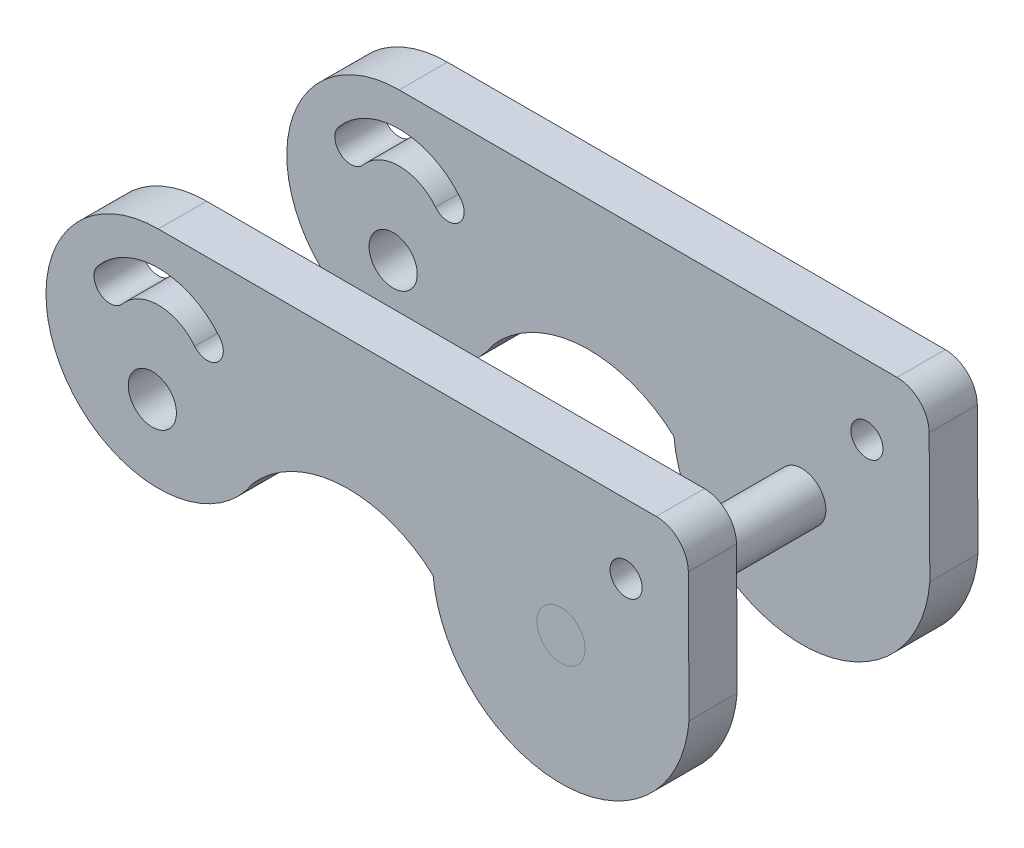
ISO-10303-21;
HEADER;
FILE_DESCRIPTION(('STEP AP214'),'2;1');
FILE_NAME('part.step','',(''),(''),'','','');
FILE_SCHEMA(('AUTOMOTIVE_DESIGN { 1 0 10303 214 1 1 1 1 }'));
ENDSEC;
DATA;
#1=APPLICATION_CONTEXT('core data for automotive mechanical design processes');
#2=APPLICATION_PROTOCOL_DEFINITION('international standard','automotive_design',2000,#1);
#3=PRODUCT_CONTEXT('',#1,'mechanical');
#4=PRODUCT('Part','Part','',(#3));
#5=PRODUCT_RELATED_PRODUCT_CATEGORY('part','',(#4));
#6=PRODUCT_DEFINITION_FORMATION('','',#4);
#7=PRODUCT_DEFINITION_CONTEXT('part definition',#1,'design');
#8=PRODUCT_DEFINITION('design','',#6,#7);
#9=PRODUCT_DEFINITION_SHAPE('','',#8);
#10=(LENGTH_UNIT() NAMED_UNIT(*) SI_UNIT(.MILLI.,.METRE.));
#11=(NAMED_UNIT(*) PLANE_ANGLE_UNIT() SI_UNIT($,.RADIAN.));
#12=(NAMED_UNIT(*) SI_UNIT($,.STERADIAN.) SOLID_ANGLE_UNIT());
#13=UNCERTAINTY_MEASURE_WITH_UNIT(LENGTH_MEASURE(1.E-05),#10,'distance_accuracy_value','');
#14=(GEOMETRIC_REPRESENTATION_CONTEXT(3) GLOBAL_UNCERTAINTY_ASSIGNED_CONTEXT((#13)) GLOBAL_UNIT_ASSIGNED_CONTEXT((#10,
#11,#12)) REPRESENTATION_CONTEXT('',''));
#15=CARTESIAN_POINT('',(0.,0.,0.));
#16=DIRECTION('',(0.,0.,1.));
#17=DIRECTION('',(1.,0.,0.));
#18=AXIS2_PLACEMENT_3D('',#15,#16,#17);
#19=CARTESIAN_POINT('',(8.75431331325364,33.2026229633381,-19.7857344309896));
#20=DIRECTION('',(0.,0.,-1.));
#21=DIRECTION('',(-1.,0.,0.));
#22=AXIS2_PLACEMENT_3D('',#19,#20,#21);
#23=CYLINDRICAL_SURFACE('',#22,1.5);
#24=CARTESIAN_POINT('',(8.75431331325364,33.2026229633381,-19.7857344309896));
#25=DIRECTION('',(0.,0.,1.));
#26=DIRECTION('',(1.,0.,0.));
#27=AXIS2_PLACEMENT_3D('',#24,#25,#26);
#28=CIRCLE('',#27,1.5);
#29=CARTESIAN_POINT('',(10.2543133132536,33.2026229633381,-19.7857344309896));
#30=VERTEX_POINT('',#29);
#31=EDGE_CURVE('P0_E9',#30,#30,#28,.T.);
#32=ORIENTED_EDGE('',*,*,#31,.F.);
#33=EDGE_LOOP('',(#32));
#34=FACE_BOUND('',#33,.T.);
#35=CARTESIAN_POINT('',(8.75431331325364,33.2026229633381,-37.7857344309896));
#36=DIRECTION('',(0.,0.,1.));
#37=DIRECTION('',(1.,0.,0.));
#38=AXIS2_PLACEMENT_3D('',#35,#36,#37);
#39=CIRCLE('',#38,1.5);
#40=CARTESIAN_POINT('',(10.2543133132536,33.2026229633381,-37.7857344309896));
#41=VERTEX_POINT('',#40);
#42=EDGE_CURVE('P0_E17',#41,#41,#39,.T.);
#43=ORIENTED_EDGE('',*,*,#42,.T.);
#44=EDGE_LOOP('',(#43));
#45=FACE_BOUND('',#44,.T.);
#46=ADVANCED_FACE('P0_F14',(#34,#45),#23,.T.);
#47=CARTESIAN_POINT('',(8.75431331325364,33.2026229633381,-19.7857344309896));
#48=DIRECTION('',(0.,0.,1.));
#49=DIRECTION('',(1.,0.,0.));
#50=AXIS2_PLACEMENT_3D('',#47,#48,#49);
#51=PLANE('',#50);
#52=ORIENTED_EDGE('',*,*,#31,.T.);
#53=EDGE_LOOP('',(#52));
#54=FACE_BOUND('',#53,.T.);
#55=ADVANCED_FACE('P0_F29',(#54),#51,.T.);
#56=CARTESIAN_POINT('',(8.75431331325364,33.2026229633381,-37.7857344309896));
#57=DIRECTION('',(0.,0.,1.));
#58=DIRECTION('',(1.,0.,0.));
#59=AXIS2_PLACEMENT_3D('',#56,#57,#58);
#60=PLANE('',#59);
#61=ORIENTED_EDGE('',*,*,#42,.F.);
#62=EDGE_LOOP('',(#61));
#63=FACE_BOUND('',#62,.T.);
#64=ADVANCED_FACE('P0_F27',(#63),#60,.F.);
#65=CLOSED_SHELL('',(#46,#55,#64));
#66=MANIFOLD_SOLID_BREP('P0_B1',#65);
#67=CARTESIAN_POINT('',(-16.3228165615196,35.5800352096352,-19.7857344309896));
#68=DIRECTION('',(0.,0.,1.));
#69=DIRECTION('',(1.,0.,0.));
#70=AXIS2_PLACEMENT_3D('',#67,#68,#69);
#71=PLANE('',#70);
#72=CARTESIAN_POINT('',(12.8113036584747,38.2810901867022,-19.7857344309896));
#73=DIRECTION('',(0.,0.,1.));
#74=DIRECTION('',(1.,0.,0.));
#75=AXIS2_PLACEMENT_3D('',#72,#73,#74);
#76=CIRCLE('',#75,1.);
#77=CARTESIAN_POINT('',(13.8113036584747,38.2810901867022,-19.7857344309896));
#78=VERTEX_POINT('',#77);
#79=EDGE_CURVE('P1_E123',#78,#78,#76,.T.);
#80=ORIENTED_EDGE('',*,*,#79,.F.);
#81=EDGE_LOOP('',(#80));
#82=FACE_BOUND('',#81,.T.);
#83=CARTESIAN_POINT('',(-16.3228165615196,35.5800352096352,-19.7857344309896));
#84=DIRECTION('',(0.,0.,1.));
#85=DIRECTION('',(1.,0.,0.));
#86=AXIS2_PLACEMENT_3D('',#83,#84,#85);
#87=CIRCLE('',#86,7.);
#88=CARTESIAN_POINT('',(-16.3228165615196,42.5800352096351,-19.7857344309896));
#89=VERTEX_POINT('',#88);
#90=CARTESIAN_POINT('',(-10.4277419329652,31.8053703074518,-19.7857344309896));
#91=VERTEX_POINT('',#90);
#92=EDGE_CURVE('P1_E139',#89,#91,#87,.T.);
#93=ORIENTED_EDGE('',*,*,#92,.T.);
#94=CARTESIAN_POINT('',(-4.50272099498319,26.5800352096352,-19.7857344309896));
#95=DIRECTION('',(0.,0.,-1.));
#96=DIRECTION('',(-1.,0.,0.));
#97=AXIS2_PLACEMENT_3D('',#94,#95,#96);
#98=CIRCLE('',#97,7.9);
#99=CARTESIAN_POINT('',(0.790300162154489,32.4446687898423,-19.7857344309896));
#100=VERTEX_POINT('',#99);
#101=EDGE_CURVE('P1_E142',#91,#100,#98,.T.);
#102=ORIENTED_EDGE('',*,*,#101,.T.);
#103=CARTESIAN_POINT('',(8.75431331325364,33.2026229633381,-19.7857344309896));
#104=DIRECTION('',(0.,0.,1.));
#105=DIRECTION('',(1.,0.,0.));
#106=AXIS2_PLACEMENT_3D('',#103,#104,#105);
#107=CIRCLE('',#106,8.);
#108=CARTESIAN_POINT('',(16.7297550170837,32.5762607448033,-19.7857344309896));
#109=VERTEX_POINT('',#108);
#110=EDGE_CURVE('P1_E145',#100,#109,#107,.T.);
#111=ORIENTED_EDGE('',*,*,#110,.T.);
#112=DIRECTION('',(-0.00525510174907032,0.999986191857471,0.));
#113=VECTOR('',#112,1.);
#114=CARTESIAN_POINT('',(16.7297550170837,32.5762607448033,-19.7857344309896));
#115=LINE('',#114,#113);
#116=CARTESIAN_POINT('',(16.6876385541555,40.5905454131333,-19.7857344309896));
#117=VERTEX_POINT('',#116);
#118=EDGE_CURVE('P1_E147',#109,#117,#115,.T.);
#119=ORIENTED_EDGE('',*,*,#118,.T.);
#120=CARTESIAN_POINT('',(14.6876661704406,40.5800352096351,-19.7857344309896));
#121=DIRECTION('',(0.,0.,1.));
#122=DIRECTION('',(-1.,0.,0.));
#123=AXIS2_PLACEMENT_3D('',#120,#121,#122);
#124=CIRCLE('',#123,2.);
#125=CARTESIAN_POINT('',(14.6876661704406,42.5800352096351,-19.7857344309896));
#126=VERTEX_POINT('',#125);
#127=EDGE_CURVE('P1_E149',#117,#126,#124,.T.);
#128=ORIENTED_EDGE('',*,*,#127,.T.);
#129=DIRECTION('',(-1.,0.,0.));
#130=VECTOR('',#129,1.);
#131=CARTESIAN_POINT('',(-16.3228165615196,42.5800352096351,-19.7857344309896));
#132=LINE('',#131,#130);
#133=EDGE_CURVE('P1_E151',#126,#89,#132,.T.);
#134=ORIENTED_EDGE('',*,*,#133,.T.);
#135=EDGE_LOOP('',(#93,#102,#111,#119,#128,#134));
#136=FACE_BOUND('',#135,.T.);
#137=CARTESIAN_POINT('',(8.75431331325364,33.2026229633381,-19.7857344309896));
#138=DIRECTION('',(0.,0.,1.));
#139=DIRECTION('',(1.,0.,0.));
#140=AXIS2_PLACEMENT_3D('',#137,#138,#139);
#141=CIRCLE('',#140,1.5);
#142=CARTESIAN_POINT('',(10.2543133132536,33.2026229633381,-19.7857344309896));
#143=VERTEX_POINT('',#142);
#144=EDGE_CURVE('P1_E133',#143,#143,#141,.T.);
#145=ORIENTED_EDGE('',*,*,#144,.F.);
#146=EDGE_LOOP('',(#145));
#147=FACE_BOUND('',#146,.T.);
#148=CARTESIAN_POINT('',(-16.3228165615196,35.5800352096352,-19.7857344309896));
#149=DIRECTION('',(0.,0.,1.));
#150=DIRECTION('',(1.,0.,0.));
#151=AXIS2_PLACEMENT_3D('',#148,#149,#150);
#152=CIRCLE('',#151,4.89513860802206);
#153=CARTESIAN_POINT('',(-12.4977183373552,38.6347046790284,-19.7857344309896));
#154=VERTEX_POINT('',#153);
#155=CARTESIAN_POINT('',(-20.1062034121941,38.6862170990118,-19.7857344309896));
#156=VERTEX_POINT('',#155);
#157=EDGE_CURVE('P1_E102',#154,#156,#152,.T.);
#158=ORIENTED_EDGE('',*,*,#157,.F.);
#159=CARTESIAN_POINT('',(-13.2791258786853,38.0106836422415,-19.7857344309896));
#160=DIRECTION('',(0.,0.,1.));
#161=DIRECTION('',(-1.,0.,0.));
#162=AXIS2_PLACEMENT_3D('',#159,#160,#161);
#163=CIRCLE('',#162,0.999999999999999);
#164=CARTESIAN_POINT('',(-14.0605334200153,37.3866626054547,-19.7857344309896));
#165=VERTEX_POINT('',#164);
#166=EDGE_CURVE('P1_E94',#165,#154,#163,.T.);
#167=ORIENTED_EDGE('',*,*,#166,.F.);
#168=CARTESIAN_POINT('',(-16.3228165615196,35.5800352096352,-19.7857344309896));
#169=DIRECTION('',(0.,0.,-1.));
#170=DIRECTION('',(1.,0.,0.));
#171=AXIS2_PLACEMENT_3D('',#168,#169,#170);
#172=CIRCLE('',#171,2.89513860802206);
#173=CARTESIAN_POINT('',(-18.5604302876193,37.417128667364,-19.7857344309896));
#174=VERTEX_POINT('',#173);
#175=EDGE_CURVE('P1_E117',#174,#165,#172,.T.);
#176=ORIENTED_EDGE('',*,*,#175,.F.);
#177=CARTESIAN_POINT('',(-19.3333168499067,38.0516728831879,-19.7857344309896));
#178=DIRECTION('',(0.,0.,1.));
#179=DIRECTION('',(1.,0.,0.));
#180=AXIS2_PLACEMENT_3D('',#177,#178,#179);
#181=CIRCLE('',#180,1.);
#182=EDGE_CURVE('P1_E115',#156,#174,#181,.T.);
#183=ORIENTED_EDGE('',*,*,#182,.F.);
#184=EDGE_LOOP('',(#158,#167,#176,#183));
#185=FACE_BOUND('',#184,.T.);
#186=CARTESIAN_POINT('',(-16.6985633335867,33.2026229633381,-19.7857344309896));
#187=DIRECTION('',(0.,0.,1.));
#188=DIRECTION('',(1.,0.,0.));
#189=AXIS2_PLACEMENT_3D('',#186,#187,#188);
#190=CIRCLE('',#189,1.5);
#191=CARTESIAN_POINT('',(-15.1985633335867,33.2026229633381,-19.7857344309896));
#192=VERTEX_POINT('',#191);
#193=EDGE_CURVE('P1_E252',#192,#192,#190,.T.);
#194=ORIENTED_EDGE('',*,*,#193,.F.);
#195=EDGE_LOOP('',(#194));
#196=FACE_BOUND('',#195,.T.);
#197=ADVANCED_FACE('P1_F17',(#82,#136,#147,#185,#196),#71,.T.);
#198=CARTESIAN_POINT('',(-16.3228165615196,35.5800352096352,-22.7857344309896));
#199=DIRECTION('',(0.,0.,1.));
#200=DIRECTION('',(1.,0.,0.));
#201=AXIS2_PLACEMENT_3D('',#198,#199,#200);
#202=PLANE('',#201);
#203=CARTESIAN_POINT('',(8.75431331325364,33.2026229633381,-22.7857344309896));
#204=DIRECTION('',(0.,0.,1.));
#205=DIRECTION('',(1.,0.,0.));
#206=AXIS2_PLACEMENT_3D('',#203,#204,#205);
#207=CIRCLE('',#206,1.5);
#208=CARTESIAN_POINT('',(10.2543133132536,33.2026229633381,-22.7857344309896));
#209=VERTEX_POINT('',#208);
#210=EDGE_CURVE('P1_E110',#209,#209,#207,.T.);
#211=ORIENTED_EDGE('',*,*,#210,.T.);
#212=EDGE_LOOP('',(#211));
#213=FACE_BOUND('',#212,.T.);
#214=CARTESIAN_POINT('',(-16.3228165615196,35.5800352096352,-22.7857344309896));
#215=DIRECTION('',(0.,0.,1.));
#216=DIRECTION('',(1.,0.,0.));
#217=AXIS2_PLACEMENT_3D('',#214,#215,#216);
#218=CIRCLE('',#217,7.);
#219=CARTESIAN_POINT('',(-16.3228165615196,42.5800352096351,-22.7857344309896));
#220=VERTEX_POINT('',#219);
#221=CARTESIAN_POINT('',(-10.4277419329652,31.8053703074518,-22.7857344309896));
#222=VERTEX_POINT('',#221);
#223=EDGE_CURVE('P1_E136',#220,#222,#218,.T.);
#224=ORIENTED_EDGE('',*,*,#223,.F.);
#225=DIRECTION('',(-1.,0.,0.));
#226=VECTOR('',#225,1.);
#227=CARTESIAN_POINT('',(-16.3228165615196,42.5800352096351,-22.7857344309896));
#228=LINE('',#227,#226);
#229=CARTESIAN_POINT('',(14.6876661704406,42.5800352096351,-22.7857344309896));
#230=VERTEX_POINT('',#229);
#231=EDGE_CURVE('P1_E143',#230,#220,#228,.T.);
#232=ORIENTED_EDGE('',*,*,#231,.F.);
#233=CARTESIAN_POINT('',(14.6876661704406,40.5800352096351,-22.7857344309896));
#234=DIRECTION('',(0.,0.,1.));
#235=DIRECTION('',(-1.,0.,0.));
#236=AXIS2_PLACEMENT_3D('',#233,#234,#235);
#237=CIRCLE('',#236,2.);
#238=CARTESIAN_POINT('',(16.6876385541555,40.5905454131333,-22.7857344309896));
#239=VERTEX_POINT('',#238);
#240=EDGE_CURVE('P1_E162',#239,#230,#237,.T.);
#241=ORIENTED_EDGE('',*,*,#240,.F.);
#242=DIRECTION('',(-0.00525510174907032,0.999986191857471,0.));
#243=VECTOR('',#242,1.);
#244=CARTESIAN_POINT('',(16.7297550170837,32.5762607448033,-22.7857344309896));
#245=LINE('',#244,#243);
#246=CARTESIAN_POINT('',(16.7297550170837,32.5762607448033,-22.7857344309896));
#247=VERTEX_POINT('',#246);
#248=EDGE_CURVE('P1_E160',#247,#239,#245,.T.);
#249=ORIENTED_EDGE('',*,*,#248,.F.);
#250=CARTESIAN_POINT('',(8.75431331325364,33.2026229633381,-22.7857344309896));
#251=DIRECTION('',(0.,0.,1.));
#252=DIRECTION('',(1.,0.,0.));
#253=AXIS2_PLACEMENT_3D('',#250,#251,#252);
#254=CIRCLE('',#253,8.);
#255=CARTESIAN_POINT('',(0.790300162154489,32.4446687898423,-22.7857344309896));
#256=VERTEX_POINT('',#255);
#257=EDGE_CURVE('P1_E158',#256,#247,#254,.T.);
#258=ORIENTED_EDGE('',*,*,#257,.F.);
#259=CARTESIAN_POINT('',(-4.50272099498319,26.5800352096352,-22.7857344309896));
#260=DIRECTION('',(0.,0.,-1.));
#261=DIRECTION('',(-1.,0.,0.));
#262=AXIS2_PLACEMENT_3D('',#259,#260,#261);
#263=CIRCLE('',#262,7.9);
#264=EDGE_CURVE('P1_E156',#222,#256,#263,.T.);
#265=ORIENTED_EDGE('',*,*,#264,.F.);
#266=EDGE_LOOP('',(#224,#232,#241,#249,#258,#265));
#267=FACE_BOUND('',#266,.T.);
#268=CARTESIAN_POINT('',(-13.2791258786853,38.0106836422415,-22.7857344309896));
#269=DIRECTION('',(0.,0.,1.));
#270=DIRECTION('',(-1.,0.,0.));
#271=AXIS2_PLACEMENT_3D('',#268,#269,#270);
#272=CIRCLE('',#271,0.999999999999999);
#273=CARTESIAN_POINT('',(-14.0605334200153,37.3866626054547,-22.7857344309896));
#274=VERTEX_POINT('',#273);
#275=CARTESIAN_POINT('',(-12.4977183373552,38.6347046790284,-22.7857344309896));
#276=VERTEX_POINT('',#275);
#277=EDGE_CURVE('P1_E40',#274,#276,#272,.T.);
#278=ORIENTED_EDGE('',*,*,#277,.T.);
#279=CARTESIAN_POINT('',(-16.3228165615196,35.5800352096352,-22.7857344309896));
#280=DIRECTION('',(0.,0.,1.));
#281=DIRECTION('',(1.,0.,0.));
#282=AXIS2_PLACEMENT_3D('',#279,#280,#281);
#283=CIRCLE('',#282,4.89513860802206);
#284=CARTESIAN_POINT('',(-20.1062034121941,38.6862170990118,-22.7857344309896));
#285=VERTEX_POINT('',#284);
#286=EDGE_CURVE('P1_E109',#276,#285,#283,.T.);
#287=ORIENTED_EDGE('',*,*,#286,.T.);
#288=CARTESIAN_POINT('',(-19.3333168499067,38.0516728831879,-22.7857344309896));
#289=DIRECTION('',(0.,0.,1.));
#290=DIRECTION('',(1.,0.,0.));
#291=AXIS2_PLACEMENT_3D('',#288,#289,#290);
#292=CIRCLE('',#291,1.);
#293=CARTESIAN_POINT('',(-18.5604302876193,37.417128667364,-22.7857344309896));
#294=VERTEX_POINT('',#293);
#295=EDGE_CURVE('P1_E125',#285,#294,#292,.T.);
#296=ORIENTED_EDGE('',*,*,#295,.T.);
#297=CARTESIAN_POINT('',(-16.3228165615196,35.5800352096352,-22.7857344309896));
#298=DIRECTION('',(0.,0.,-1.));
#299=DIRECTION('',(1.,0.,0.));
#300=AXIS2_PLACEMENT_3D('',#297,#298,#299);
#301=CIRCLE('',#300,2.89513860802206);
#302=EDGE_CURVE('P1_E103',#294,#274,#301,.T.);
#303=ORIENTED_EDGE('',*,*,#302,.T.);
#304=EDGE_LOOP('',(#278,#287,#296,#303));
#305=FACE_BOUND('',#304,.T.);
#306=CARTESIAN_POINT('',(12.8113036584747,38.2810901867022,-22.7857344309896));
#307=DIRECTION('',(0.,0.,1.));
#308=DIRECTION('',(1.,0.,0.));
#309=AXIS2_PLACEMENT_3D('',#306,#307,#308);
#310=CIRCLE('',#309,1.);
#311=CARTESIAN_POINT('',(13.8113036584747,38.2810901867022,-22.7857344309896));
#312=VERTEX_POINT('',#311);
#313=EDGE_CURVE('P1_E258',#312,#312,#310,.T.);
#314=ORIENTED_EDGE('',*,*,#313,.T.);
#315=EDGE_LOOP('',(#314));
#316=FACE_BOUND('',#315,.T.);
#317=CARTESIAN_POINT('',(-16.6985633335867,33.2026229633381,-22.7857344309896));
#318=DIRECTION('',(0.,0.,1.));
#319=DIRECTION('',(1.,0.,0.));
#320=AXIS2_PLACEMENT_3D('',#317,#318,#319);
#321=CIRCLE('',#320,1.5);
#322=CARTESIAN_POINT('',(-15.1985633335867,33.2026229633381,-22.7857344309896));
#323=VERTEX_POINT('',#322);
#324=EDGE_CURVE('P1_E255',#323,#323,#321,.T.);
#325=ORIENTED_EDGE('',*,*,#324,.T.);
#326=EDGE_LOOP('',(#325));
#327=FACE_BOUND('',#326,.T.);
#328=ADVANCED_FACE('P1_F186',(#213,#267,#305,#316,#327),#202,.F.);
#329=CARTESIAN_POINT('',(-16.3228165615196,35.5800352096352,-19.7857344309896));
#330=DIRECTION('',(0.,0.,-1.));
#331=DIRECTION('',(-1.,0.,0.));
#332=AXIS2_PLACEMENT_3D('',#329,#330,#331);
#333=CYLINDRICAL_SURFACE('',#332,7.);
#334=ORIENTED_EDGE('',*,*,#223,.T.);
#335=DIRECTION('',(0.,0.,-1.));
#336=VECTOR('',#335,1.);
#337=CARTESIAN_POINT('',(-10.4277419329652,31.8053703074518,-19.7857344309896));
#338=LINE('',#337,#336);
#339=EDGE_CURVE('P1_E11',#91,#222,#338,.T.);
#340=ORIENTED_EDGE('',*,*,#339,.F.);
#341=ORIENTED_EDGE('',*,*,#92,.F.);
#342=DIRECTION('',(0.,0.,-1.));
#343=VECTOR('',#342,1.);
#344=CARTESIAN_POINT('',(-16.3228165615196,42.5800352096351,-19.7857344309896));
#345=LINE('',#344,#343);
#346=EDGE_CURVE('P1_E153',#89,#220,#345,.T.);
#347=ORIENTED_EDGE('',*,*,#346,.T.);
#348=EDGE_LOOP('',(#334,#340,#341,#347));
#349=FACE_BOUND('',#348,.T.);
#350=ADVANCED_FACE('P1_F19',(#349),#333,.T.);
#351=CARTESIAN_POINT('',(-4.50272099498319,26.5800352096352,-19.7857344309896));
#352=DIRECTION('',(0.,0.,-1.));
#353=DIRECTION('',(-1.,0.,0.));
#354=AXIS2_PLACEMENT_3D('',#351,#352,#353);
#355=CYLINDRICAL_SURFACE('',#354,7.9);
#356=ORIENTED_EDGE('',*,*,#264,.T.);
#357=DIRECTION('',(0.,0.,-1.));
#358=VECTOR('',#357,1.);
#359=CARTESIAN_POINT('',(0.790300162154489,32.4446687898423,-19.7857344309896));
#360=LINE('',#359,#358);
#361=EDGE_CURVE('P1_E25',#100,#256,#360,.T.);
#362=ORIENTED_EDGE('',*,*,#361,.F.);
#363=ORIENTED_EDGE('',*,*,#101,.F.);
#364=ORIENTED_EDGE('',*,*,#339,.T.);
#365=EDGE_LOOP('',(#356,#362,#363,#364));
#366=FACE_BOUND('',#365,.T.);
#367=ADVANCED_FACE('P1_F204',(#366),#355,.F.);
#368=CARTESIAN_POINT('',(8.75431331325364,33.2026229633381,-19.7857344309896));
#369=DIRECTION('',(0.,0.,-1.));
#370=DIRECTION('',(-1.,0.,0.));
#371=AXIS2_PLACEMENT_3D('',#368,#369,#370);
#372=CYLINDRICAL_SURFACE('',#371,8.);
#373=ORIENTED_EDGE('',*,*,#257,.T.);
#374=DIRECTION('',(0.,0.,-1.));
#375=VECTOR('',#374,1.);
#376=CARTESIAN_POINT('',(16.7297550170837,32.5762607448033,-19.7857344309896));
#377=LINE('',#376,#375);
#378=EDGE_CURVE('P1_E173',#109,#247,#377,.T.);
#379=ORIENTED_EDGE('',*,*,#378,.F.);
#380=ORIENTED_EDGE('',*,*,#110,.F.);
#381=ORIENTED_EDGE('',*,*,#361,.T.);
#382=EDGE_LOOP('',(#373,#379,#380,#381));
#383=FACE_BOUND('',#382,.T.);
#384=ADVANCED_FACE('P1_F180',(#383),#372,.T.);
#385=CARTESIAN_POINT('',(16.7297550170837,32.5762607448033,-19.7857344309896));
#386=DIRECTION('',(-0.999986191857471,-0.00525510174907032,0.));
#387=DIRECTION('',(0.00525510174907032,-0.999986191857471,0.));
#388=AXIS2_PLACEMENT_3D('',#385,#386,#387);
#389=PLANE('',#388);
#390=ORIENTED_EDGE('',*,*,#248,.T.);
#391=DIRECTION('',(0.,0.,-1.));
#392=VECTOR('',#391,1.);
#393=CARTESIAN_POINT('',(16.6876385541555,40.5905454131333,-19.7857344309896));
#394=LINE('',#393,#392);
#395=EDGE_CURVE('P1_E170',#117,#239,#394,.T.);
#396=ORIENTED_EDGE('',*,*,#395,.F.);
#397=ORIENTED_EDGE('',*,*,#118,.F.);
#398=ORIENTED_EDGE('',*,*,#378,.T.);
#399=EDGE_LOOP('',(#390,#396,#397,#398));
#400=FACE_BOUND('',#399,.T.);
#401=ADVANCED_FACE('P1_F192',(#400),#389,.F.);
#402=CARTESIAN_POINT('',(14.6876661704406,40.5800352096351,-19.7857344309896));
#403=DIRECTION('',(0.,0.,-1.));
#404=DIRECTION('',(-1.,0.,0.));
#405=AXIS2_PLACEMENT_3D('',#402,#403,#404);
#406=CYLINDRICAL_SURFACE('',#405,2.);
#407=ORIENTED_EDGE('',*,*,#240,.T.);
#408=DIRECTION('',(0.,0.,-1.));
#409=VECTOR('',#408,1.);
#410=CARTESIAN_POINT('',(14.6876661704406,42.5800352096351,-19.7857344309896));
#411=LINE('',#410,#409);
#412=EDGE_CURVE('P1_E167',#126,#230,#411,.T.);
#413=ORIENTED_EDGE('',*,*,#412,.F.);
#414=ORIENTED_EDGE('',*,*,#127,.F.);
#415=ORIENTED_EDGE('',*,*,#395,.T.);
#416=EDGE_LOOP('',(#407,#413,#414,#415));
#417=FACE_BOUND('',#416,.T.);
#418=ADVANCED_FACE('P1_F196',(#417),#406,.T.);
#419=CARTESIAN_POINT('',(-16.3228165615196,42.5800352096351,-19.7857344309896));
#420=DIRECTION('',(0.,-1.,0.));
#421=DIRECTION('',(0.,0.,-1.));
#422=AXIS2_PLACEMENT_3D('',#419,#420,#421);
#423=PLANE('',#422);
#424=ORIENTED_EDGE('',*,*,#231,.T.);
#425=ORIENTED_EDGE('',*,*,#346,.F.);
#426=ORIENTED_EDGE('',*,*,#133,.F.);
#427=ORIENTED_EDGE('',*,*,#412,.T.);
#428=EDGE_LOOP('',(#424,#425,#426,#427));
#429=FACE_BOUND('',#428,.T.);
#430=ADVANCED_FACE('P1_F207',(#429),#423,.F.);
#431=CARTESIAN_POINT('',(8.75431331325364,33.2026229633381,-19.7857344309896));
#432=DIRECTION('',(0.,0.,-1.));
#433=DIRECTION('',(-1.,0.,0.));
#434=AXIS2_PLACEMENT_3D('',#431,#432,#433);
#435=CYLINDRICAL_SURFACE('',#434,1.5);
#436=ORIENTED_EDGE('',*,*,#144,.T.);
#437=EDGE_LOOP('',(#436));
#438=FACE_BOUND('',#437,.T.);
#439=ORIENTED_EDGE('',*,*,#210,.F.);
#440=EDGE_LOOP('',(#439));
#441=FACE_BOUND('',#440,.T.);
#442=ADVANCED_FACE('P1_F209',(#438,#441),#435,.F.);
#443=CARTESIAN_POINT('',(-13.2791258786853,38.0106836422415,-19.7857344309896));
#444=DIRECTION('',(0.,0.,-1.));
#445=DIRECTION('',(-1.,0.,0.));
#446=AXIS2_PLACEMENT_3D('',#443,#444,#445);
#447=CYLINDRICAL_SURFACE('',#446,0.999999999999999);
#448=ORIENTED_EDGE('',*,*,#277,.F.);
#449=DIRECTION('',(0.,0.,-1.));
#450=VECTOR('',#449,1.);
#451=CARTESIAN_POINT('',(-14.0605334200153,37.3866626054547,-19.7857344309896));
#452=LINE('',#451,#450);
#453=EDGE_CURVE('P1_E98',#165,#274,#452,.T.);
#454=ORIENTED_EDGE('',*,*,#453,.F.);
#455=ORIENTED_EDGE('',*,*,#166,.T.);
#456=DIRECTION('',(0.,0.,-1.));
#457=VECTOR('',#456,1.);
#458=CARTESIAN_POINT('',(-12.4977183373552,38.6347046790284,-19.7857344309896));
#459=LINE('',#458,#457);
#460=EDGE_CURVE('P1_E97',#154,#276,#459,.T.);
#461=ORIENTED_EDGE('',*,*,#460,.T.);
#462=EDGE_LOOP('',(#448,#454,#455,#461));
#463=FACE_BOUND('',#462,.T.);
#464=ADVANCED_FACE('P1_F96',(#463),#447,.F.);
#465=CARTESIAN_POINT('',(-16.3228165615196,35.5800352096352,-19.7857344309896));
#466=DIRECTION('',(0.,0.,-1.));
#467=DIRECTION('',(-1.,0.,0.));
#468=AXIS2_PLACEMENT_3D('',#465,#466,#467);
#469=CYLINDRICAL_SURFACE('',#468,4.89513860802206);
#470=ORIENTED_EDGE('',*,*,#286,.F.);
#471=ORIENTED_EDGE('',*,*,#460,.F.);
#472=ORIENTED_EDGE('',*,*,#157,.T.);
#473=DIRECTION('',(0.,0.,-1.));
#474=VECTOR('',#473,1.);
#475=CARTESIAN_POINT('',(-20.1062034121941,38.6862170990118,-19.7857344309896));
#476=LINE('',#475,#474);
#477=EDGE_CURVE('P1_E111',#156,#285,#476,.T.);
#478=ORIENTED_EDGE('',*,*,#477,.T.);
#479=EDGE_LOOP('',(#470,#471,#472,#478));
#480=FACE_BOUND('',#479,.T.);
#481=ADVANCED_FACE('P1_F106',(#480),#469,.F.);
#482=CARTESIAN_POINT('',(-19.3333168499067,38.0516728831879,-19.7857344309896));
#483=DIRECTION('',(0.,0.,-1.));
#484=DIRECTION('',(-1.,0.,0.));
#485=AXIS2_PLACEMENT_3D('',#482,#483,#484);
#486=CYLINDRICAL_SURFACE('',#485,1.);
#487=ORIENTED_EDGE('',*,*,#295,.F.);
#488=ORIENTED_EDGE('',*,*,#477,.F.);
#489=ORIENTED_EDGE('',*,*,#182,.T.);
#490=DIRECTION('',(0.,0.,-1.));
#491=VECTOR('',#490,1.);
#492=CARTESIAN_POINT('',(-18.5604302876193,37.417128667364,-19.7857344309896));
#493=LINE('',#492,#491);
#494=EDGE_CURVE('P1_E32',#174,#294,#493,.T.);
#495=ORIENTED_EDGE('',*,*,#494,.T.);
#496=EDGE_LOOP('',(#487,#488,#489,#495));
#497=FACE_BOUND('',#496,.T.);
#498=ADVANCED_FACE('P1_F233',(#497),#486,.F.);
#499=CARTESIAN_POINT('',(-16.3228165615196,35.5800352096352,-19.7857344309896));
#500=DIRECTION('',(0.,0.,-1.));
#501=DIRECTION('',(-1.,0.,0.));
#502=AXIS2_PLACEMENT_3D('',#499,#500,#501);
#503=CYLINDRICAL_SURFACE('',#502,2.89513860802206);
#504=ORIENTED_EDGE('',*,*,#302,.F.);
#505=ORIENTED_EDGE('',*,*,#494,.F.);
#506=ORIENTED_EDGE('',*,*,#175,.T.);
#507=ORIENTED_EDGE('',*,*,#453,.T.);
#508=EDGE_LOOP('',(#504,#505,#506,#507));
#509=FACE_BOUND('',#508,.T.);
#510=ADVANCED_FACE('P1_F236',(#509),#503,.T.);
#511=CARTESIAN_POINT('',(12.8113036584747,38.2810901867022,-19.7857344309896));
#512=DIRECTION('',(0.,0.,-1.));
#513=DIRECTION('',(-1.,0.,0.));
#514=AXIS2_PLACEMENT_3D('',#511,#512,#513);
#515=CYLINDRICAL_SURFACE('',#514,1.);
#516=ORIENTED_EDGE('',*,*,#79,.T.);
#517=EDGE_LOOP('',(#516));
#518=FACE_BOUND('',#517,.T.);
#519=ORIENTED_EDGE('',*,*,#313,.F.);
#520=EDGE_LOOP('',(#519));
#521=FACE_BOUND('',#520,.T.);
#522=ADVANCED_FACE('P1_F240',(#518,#521),#515,.F.);
#523=CARTESIAN_POINT('',(-16.6985633335867,33.2026229633381,-19.7857344309896));
#524=DIRECTION('',(0.,0.,-1.));
#525=DIRECTION('',(-1.,0.,0.));
#526=AXIS2_PLACEMENT_3D('',#523,#524,#525);
#527=CYLINDRICAL_SURFACE('',#526,1.5);
#528=ORIENTED_EDGE('',*,*,#193,.T.);
#529=EDGE_LOOP('',(#528));
#530=FACE_BOUND('',#529,.T.);
#531=ORIENTED_EDGE('',*,*,#324,.F.);
#532=EDGE_LOOP('',(#531));
#533=FACE_BOUND('',#532,.T.);
#534=ADVANCED_FACE('P1_F243',(#530,#533),#527,.F.);
#535=CLOSED_SHELL('',(#197,#328,#350,#367,#384,#401,#418,#430,#442,#464,#481,#498,#510,#522,#534));
#536=MANIFOLD_SOLID_BREP('P1_B1',#535);
#537=CARTESIAN_POINT('',(-16.3228165615196,35.5800352096352,-34.7857344309896));
#538=DIRECTION('',(0.,0.,1.));
#539=DIRECTION('',(1.,0.,0.));
#540=AXIS2_PLACEMENT_3D('',#537,#538,#539);
#541=PLANE('',#540);
#542=CARTESIAN_POINT('',(12.8113036584747,38.2810901867022,-34.7857344309896));
#543=DIRECTION('',(0.,0.,1.));
#544=DIRECTION('',(1.,0.,0.));
#545=AXIS2_PLACEMENT_3D('',#542,#543,#544);
#546=CIRCLE('',#545,1.);
#547=CARTESIAN_POINT('',(13.8113036584747,38.2810901867022,-34.7857344309896));
#548=VERTEX_POINT('',#547);
#549=EDGE_CURVE('P2_E123',#548,#548,#546,.T.);
#550=ORIENTED_EDGE('',*,*,#549,.F.);
#551=EDGE_LOOP('',(#550));
#552=FACE_BOUND('',#551,.T.);
#553=CARTESIAN_POINT('',(-16.3228165615196,35.5800352096352,-34.7857344309896));
#554=DIRECTION('',(0.,0.,1.));
#555=DIRECTION('',(1.,0.,0.));
#556=AXIS2_PLACEMENT_3D('',#553,#554,#555);
#557=CIRCLE('',#556,7.);
#558=CARTESIAN_POINT('',(-16.3228165615196,42.5800352096351,-34.7857344309896));
#559=VERTEX_POINT('',#558);
#560=CARTESIAN_POINT('',(-10.4277419329652,31.8053703074518,-34.7857344309896));
#561=VERTEX_POINT('',#560);
#562=EDGE_CURVE('P2_E139',#559,#561,#557,.T.);
#563=ORIENTED_EDGE('',*,*,#562,.T.);
#564=CARTESIAN_POINT('',(-4.50272099498319,26.5800352096352,-34.7857344309896));
#565=DIRECTION('',(0.,0.,-1.));
#566=DIRECTION('',(-1.,0.,0.));
#567=AXIS2_PLACEMENT_3D('',#564,#565,#566);
#568=CIRCLE('',#567,7.9);
#569=CARTESIAN_POINT('',(0.790300162154489,32.4446687898423,-34.7857344309896));
#570=VERTEX_POINT('',#569);
#571=EDGE_CURVE('P2_E142',#561,#570,#568,.T.);
#572=ORIENTED_EDGE('',*,*,#571,.T.);
#573=CARTESIAN_POINT('',(8.75431331325364,33.2026229633381,-34.7857344309896));
#574=DIRECTION('',(0.,0.,1.));
#575=DIRECTION('',(1.,0.,0.));
#576=AXIS2_PLACEMENT_3D('',#573,#574,#575);
#577=CIRCLE('',#576,8.);
#578=CARTESIAN_POINT('',(16.7297550170837,32.5762607448033,-34.7857344309896));
#579=VERTEX_POINT('',#578);
#580=EDGE_CURVE('P2_E145',#570,#579,#577,.T.);
#581=ORIENTED_EDGE('',*,*,#580,.T.);
#582=DIRECTION('',(-0.00525510174907032,0.999986191857471,0.));
#583=VECTOR('',#582,1.);
#584=CARTESIAN_POINT('',(16.7297550170837,32.5762607448033,-34.7857344309896));
#585=LINE('',#584,#583);
#586=CARTESIAN_POINT('',(16.6876385541555,40.5905454131333,-34.7857344309896));
#587=VERTEX_POINT('',#586);
#588=EDGE_CURVE('P2_E147',#579,#587,#585,.T.);
#589=ORIENTED_EDGE('',*,*,#588,.T.);
#590=CARTESIAN_POINT('',(14.6876661704406,40.5800352096351,-34.7857344309896));
#591=DIRECTION('',(0.,0.,1.));
#592=DIRECTION('',(-1.,0.,0.));
#593=AXIS2_PLACEMENT_3D('',#590,#591,#592);
#594=CIRCLE('',#593,2.);
#595=CARTESIAN_POINT('',(14.6876661704406,42.5800352096351,-34.7857344309896));
#596=VERTEX_POINT('',#595);
#597=EDGE_CURVE('P2_E149',#587,#596,#594,.T.);
#598=ORIENTED_EDGE('',*,*,#597,.T.);
#599=DIRECTION('',(-1.,0.,0.));
#600=VECTOR('',#599,1.);
#601=CARTESIAN_POINT('',(-16.3228165615196,42.5800352096351,-34.7857344309896));
#602=LINE('',#601,#600);
#603=EDGE_CURVE('P2_E151',#596,#559,#602,.T.);
#604=ORIENTED_EDGE('',*,*,#603,.T.);
#605=EDGE_LOOP('',(#563,#572,#581,#589,#598,#604));
#606=FACE_BOUND('',#605,.T.);
#607=CARTESIAN_POINT('',(8.75431331325364,33.2026229633381,-34.7857344309896));
#608=DIRECTION('',(0.,0.,1.));
#609=DIRECTION('',(1.,0.,0.));
#610=AXIS2_PLACEMENT_3D('',#607,#608,#609);
#611=CIRCLE('',#610,1.5);
#612=CARTESIAN_POINT('',(10.2543133132536,33.2026229633381,-34.7857344309896));
#613=VERTEX_POINT('',#612);
#614=EDGE_CURVE('P2_E133',#613,#613,#611,.T.);
#615=ORIENTED_EDGE('',*,*,#614,.F.);
#616=EDGE_LOOP('',(#615));
#617=FACE_BOUND('',#616,.T.);
#618=CARTESIAN_POINT('',(-16.3228165615196,35.5800352096352,-34.7857344309896));
#619=DIRECTION('',(0.,0.,1.));
#620=DIRECTION('',(1.,0.,0.));
#621=AXIS2_PLACEMENT_3D('',#618,#619,#620);
#622=CIRCLE('',#621,4.89513860802206);
#623=CARTESIAN_POINT('',(-12.4977183373552,38.6347046790284,-34.7857344309896));
#624=VERTEX_POINT('',#623);
#625=CARTESIAN_POINT('',(-20.1062034121941,38.6862170990118,-34.7857344309896));
#626=VERTEX_POINT('',#625);
#627=EDGE_CURVE('P2_E102',#624,#626,#622,.T.);
#628=ORIENTED_EDGE('',*,*,#627,.F.);
#629=CARTESIAN_POINT('',(-13.2791258786853,38.0106836422415,-34.7857344309896));
#630=DIRECTION('',(0.,0.,1.));
#631=DIRECTION('',(-1.,0.,0.));
#632=AXIS2_PLACEMENT_3D('',#629,#630,#631);
#633=CIRCLE('',#632,0.999999999999999);
#634=CARTESIAN_POINT('',(-14.0605334200153,37.3866626054547,-34.7857344309896));
#635=VERTEX_POINT('',#634);
#636=EDGE_CURVE('P2_E94',#635,#624,#633,.T.);
#637=ORIENTED_EDGE('',*,*,#636,.F.);
#638=CARTESIAN_POINT('',(-16.3228165615196,35.5800352096352,-34.7857344309896));
#639=DIRECTION('',(0.,0.,-1.));
#640=DIRECTION('',(1.,0.,0.));
#641=AXIS2_PLACEMENT_3D('',#638,#639,#640);
#642=CIRCLE('',#641,2.89513860802206);
#643=CARTESIAN_POINT('',(-18.5604302876193,37.417128667364,-34.7857344309896));
#644=VERTEX_POINT('',#643);
#645=EDGE_CURVE('P2_E117',#644,#635,#642,.T.);
#646=ORIENTED_EDGE('',*,*,#645,.F.);
#647=CARTESIAN_POINT('',(-19.3333168499067,38.0516728831879,-34.7857344309896));
#648=DIRECTION('',(0.,0.,1.));
#649=DIRECTION('',(1.,0.,0.));
#650=AXIS2_PLACEMENT_3D('',#647,#648,#649);
#651=CIRCLE('',#650,1.);
#652=EDGE_CURVE('P2_E115',#626,#644,#651,.T.);
#653=ORIENTED_EDGE('',*,*,#652,.F.);
#654=EDGE_LOOP('',(#628,#637,#646,#653));
#655=FACE_BOUND('',#654,.T.);
#656=CARTESIAN_POINT('',(-16.6985633335867,33.2026229633381,-34.7857344309896));
#657=DIRECTION('',(0.,0.,1.));
#658=DIRECTION('',(1.,0.,0.));
#659=AXIS2_PLACEMENT_3D('',#656,#657,#658);
#660=CIRCLE('',#659,1.5);
#661=CARTESIAN_POINT('',(-15.1985633335867,33.2026229633381,-34.7857344309896));
#662=VERTEX_POINT('',#661);
#663=EDGE_CURVE('P2_E252',#662,#662,#660,.T.);
#664=ORIENTED_EDGE('',*,*,#663,.F.);
#665=EDGE_LOOP('',(#664));
#666=FACE_BOUND('',#665,.T.);
#667=ADVANCED_FACE('P2_F17',(#552,#606,#617,#655,#666),#541,.T.);
#668=CARTESIAN_POINT('',(-16.3228165615196,35.5800352096352,-37.7857344309896));
#669=DIRECTION('',(0.,0.,1.));
#670=DIRECTION('',(1.,0.,0.));
#671=AXIS2_PLACEMENT_3D('',#668,#669,#670);
#672=PLANE('',#671);
#673=CARTESIAN_POINT('',(8.75431331325364,33.2026229633381,-37.7857344309896));
#674=DIRECTION('',(0.,0.,1.));
#675=DIRECTION('',(1.,0.,0.));
#676=AXIS2_PLACEMENT_3D('',#673,#674,#675);
#677=CIRCLE('',#676,1.5);
#678=CARTESIAN_POINT('',(10.2543133132536,33.2026229633381,-37.7857344309896));
#679=VERTEX_POINT('',#678);
#680=EDGE_CURVE('P2_E110',#679,#679,#677,.T.);
#681=ORIENTED_EDGE('',*,*,#680,.T.);
#682=EDGE_LOOP('',(#681));
#683=FACE_BOUND('',#682,.T.);
#684=CARTESIAN_POINT('',(-16.3228165615196,35.5800352096352,-37.7857344309896));
#685=DIRECTION('',(0.,0.,1.));
#686=DIRECTION('',(1.,0.,0.));
#687=AXIS2_PLACEMENT_3D('',#684,#685,#686);
#688=CIRCLE('',#687,7.);
#689=CARTESIAN_POINT('',(-16.3228165615196,42.5800352096351,-37.7857344309896));
#690=VERTEX_POINT('',#689);
#691=CARTESIAN_POINT('',(-10.4277419329652,31.8053703074518,-37.7857344309896));
#692=VERTEX_POINT('',#691);
#693=EDGE_CURVE('P2_E136',#690,#692,#688,.T.);
#694=ORIENTED_EDGE('',*,*,#693,.F.);
#695=DIRECTION('',(-1.,0.,0.));
#696=VECTOR('',#695,1.);
#697=CARTESIAN_POINT('',(-16.3228165615196,42.5800352096351,-37.7857344309896));
#698=LINE('',#697,#696);
#699=CARTESIAN_POINT('',(14.6876661704406,42.5800352096351,-37.7857344309896));
#700=VERTEX_POINT('',#699);
#701=EDGE_CURVE('P2_E143',#700,#690,#698,.T.);
#702=ORIENTED_EDGE('',*,*,#701,.F.);
#703=CARTESIAN_POINT('',(14.6876661704406,40.5800352096351,-37.7857344309896));
#704=DIRECTION('',(0.,0.,1.));
#705=DIRECTION('',(-1.,0.,0.));
#706=AXIS2_PLACEMENT_3D('',#703,#704,#705);
#707=CIRCLE('',#706,2.);
#708=CARTESIAN_POINT('',(16.6876385541555,40.5905454131333,-37.7857344309896));
#709=VERTEX_POINT('',#708);
#710=EDGE_CURVE('P2_E162',#709,#700,#707,.T.);
#711=ORIENTED_EDGE('',*,*,#710,.F.);
#712=DIRECTION('',(-0.00525510174907032,0.999986191857471,0.));
#713=VECTOR('',#712,1.);
#714=CARTESIAN_POINT('',(16.7297550170837,32.5762607448033,-37.7857344309896));
#715=LINE('',#714,#713);
#716=CARTESIAN_POINT('',(16.7297550170837,32.5762607448033,-37.7857344309896));
#717=VERTEX_POINT('',#716);
#718=EDGE_CURVE('P2_E160',#717,#709,#715,.T.);
#719=ORIENTED_EDGE('',*,*,#718,.F.);
#720=CARTESIAN_POINT('',(8.75431331325364,33.2026229633381,-37.7857344309896));
#721=DIRECTION('',(0.,0.,1.));
#722=DIRECTION('',(1.,0.,0.));
#723=AXIS2_PLACEMENT_3D('',#720,#721,#722);
#724=CIRCLE('',#723,8.);
#725=CARTESIAN_POINT('',(0.790300162154489,32.4446687898423,-37.7857344309896));
#726=VERTEX_POINT('',#725);
#727=EDGE_CURVE('P2_E158',#726,#717,#724,.T.);
#728=ORIENTED_EDGE('',*,*,#727,.F.);
#729=CARTESIAN_POINT('',(-4.50272099498319,26.5800352096352,-37.7857344309896));
#730=DIRECTION('',(0.,0.,-1.));
#731=DIRECTION('',(-1.,0.,0.));
#732=AXIS2_PLACEMENT_3D('',#729,#730,#731);
#733=CIRCLE('',#732,7.9);
#734=EDGE_CURVE('P2_E156',#692,#726,#733,.T.);
#735=ORIENTED_EDGE('',*,*,#734,.F.);
#736=EDGE_LOOP('',(#694,#702,#711,#719,#728,#735));
#737=FACE_BOUND('',#736,.T.);
#738=CARTESIAN_POINT('',(-13.2791258786853,38.0106836422415,-37.7857344309896));
#739=DIRECTION('',(0.,0.,1.));
#740=DIRECTION('',(-1.,0.,0.));
#741=AXIS2_PLACEMENT_3D('',#738,#739,#740);
#742=CIRCLE('',#741,0.999999999999999);
#743=CARTESIAN_POINT('',(-14.0605334200153,37.3866626054547,-37.7857344309896));
#744=VERTEX_POINT('',#743);
#745=CARTESIAN_POINT('',(-12.4977183373552,38.6347046790284,-37.7857344309896));
#746=VERTEX_POINT('',#745);
#747=EDGE_CURVE('P2_E40',#744,#746,#742,.T.);
#748=ORIENTED_EDGE('',*,*,#747,.T.);
#749=CARTESIAN_POINT('',(-16.3228165615196,35.5800352096352,-37.7857344309896));
#750=DIRECTION('',(0.,0.,1.));
#751=DIRECTION('',(1.,0.,0.));
#752=AXIS2_PLACEMENT_3D('',#749,#750,#751);
#753=CIRCLE('',#752,4.89513860802206);
#754=CARTESIAN_POINT('',(-20.1062034121941,38.6862170990118,-37.7857344309896));
#755=VERTEX_POINT('',#754);
#756=EDGE_CURVE('P2_E109',#746,#755,#753,.T.);
#757=ORIENTED_EDGE('',*,*,#756,.T.);
#758=CARTESIAN_POINT('',(-19.3333168499067,38.0516728831879,-37.7857344309896));
#759=DIRECTION('',(0.,0.,1.));
#760=DIRECTION('',(1.,0.,0.));
#761=AXIS2_PLACEMENT_3D('',#758,#759,#760);
#762=CIRCLE('',#761,1.);
#763=CARTESIAN_POINT('',(-18.5604302876193,37.417128667364,-37.7857344309896));
#764=VERTEX_POINT('',#763);
#765=EDGE_CURVE('P2_E125',#755,#764,#762,.T.);
#766=ORIENTED_EDGE('',*,*,#765,.T.);
#767=CARTESIAN_POINT('',(-16.3228165615196,35.5800352096352,-37.7857344309896));
#768=DIRECTION('',(0.,0.,-1.));
#769=DIRECTION('',(1.,0.,0.));
#770=AXIS2_PLACEMENT_3D('',#767,#768,#769);
#771=CIRCLE('',#770,2.89513860802206);
#772=EDGE_CURVE('P2_E103',#764,#744,#771,.T.);
#773=ORIENTED_EDGE('',*,*,#772,.T.);
#774=EDGE_LOOP('',(#748,#757,#766,#773));
#775=FACE_BOUND('',#774,.T.);
#776=CARTESIAN_POINT('',(12.8113036584747,38.2810901867022,-37.7857344309896));
#777=DIRECTION('',(0.,0.,1.));
#778=DIRECTION('',(1.,0.,0.));
#779=AXIS2_PLACEMENT_3D('',#776,#777,#778);
#780=CIRCLE('',#779,1.);
#781=CARTESIAN_POINT('',(13.8113036584747,38.2810901867022,-37.7857344309896));
#782=VERTEX_POINT('',#781);
#783=EDGE_CURVE('P2_E258',#782,#782,#780,.T.);
#784=ORIENTED_EDGE('',*,*,#783,.T.);
#785=EDGE_LOOP('',(#784));
#786=FACE_BOUND('',#785,.T.);
#787=CARTESIAN_POINT('',(-16.6985633335867,33.2026229633381,-37.7857344309896));
#788=DIRECTION('',(0.,0.,1.));
#789=DIRECTION('',(1.,0.,0.));
#790=AXIS2_PLACEMENT_3D('',#787,#788,#789);
#791=CIRCLE('',#790,1.5);
#792=CARTESIAN_POINT('',(-15.1985633335867,33.2026229633381,-37.7857344309896));
#793=VERTEX_POINT('',#792);
#794=EDGE_CURVE('P2_E255',#793,#793,#791,.T.);
#795=ORIENTED_EDGE('',*,*,#794,.T.);
#796=EDGE_LOOP('',(#795));
#797=FACE_BOUND('',#796,.T.);
#798=ADVANCED_FACE('P2_F186',(#683,#737,#775,#786,#797),#672,.F.);
#799=CARTESIAN_POINT('',(-16.3228165615196,35.5800352096352,-34.7857344309896));
#800=DIRECTION('',(0.,0.,-1.));
#801=DIRECTION('',(-1.,0.,0.));
#802=AXIS2_PLACEMENT_3D('',#799,#800,#801);
#803=CYLINDRICAL_SURFACE('',#802,7.);
#804=ORIENTED_EDGE('',*,*,#693,.T.);
#805=DIRECTION('',(0.,0.,-1.));
#806=VECTOR('',#805,1.);
#807=CARTESIAN_POINT('',(-10.4277419329652,31.8053703074518,-34.7857344309896));
#808=LINE('',#807,#806);
#809=EDGE_CURVE('P2_E11',#561,#692,#808,.T.);
#810=ORIENTED_EDGE('',*,*,#809,.F.);
#811=ORIENTED_EDGE('',*,*,#562,.F.);
#812=DIRECTION('',(0.,0.,-1.));
#813=VECTOR('',#812,1.);
#814=CARTESIAN_POINT('',(-16.3228165615196,42.5800352096351,-34.7857344309896));
#815=LINE('',#814,#813);
#816=EDGE_CURVE('P2_E153',#559,#690,#815,.T.);
#817=ORIENTED_EDGE('',*,*,#816,.T.);
#818=EDGE_LOOP('',(#804,#810,#811,#817));
#819=FACE_BOUND('',#818,.T.);
#820=ADVANCED_FACE('P2_F19',(#819),#803,.T.);
#821=CARTESIAN_POINT('',(-4.50272099498319,26.5800352096352,-34.7857344309896));
#822=DIRECTION('',(0.,0.,-1.));
#823=DIRECTION('',(-1.,0.,0.));
#824=AXIS2_PLACEMENT_3D('',#821,#822,#823);
#825=CYLINDRICAL_SURFACE('',#824,7.9);
#826=ORIENTED_EDGE('',*,*,#734,.T.);
#827=DIRECTION('',(0.,0.,-1.));
#828=VECTOR('',#827,1.);
#829=CARTESIAN_POINT('',(0.790300162154489,32.4446687898423,-34.7857344309896));
#830=LINE('',#829,#828);
#831=EDGE_CURVE('P2_E25',#570,#726,#830,.T.);
#832=ORIENTED_EDGE('',*,*,#831,.F.);
#833=ORIENTED_EDGE('',*,*,#571,.F.);
#834=ORIENTED_EDGE('',*,*,#809,.T.);
#835=EDGE_LOOP('',(#826,#832,#833,#834));
#836=FACE_BOUND('',#835,.T.);
#837=ADVANCED_FACE('P2_F204',(#836),#825,.F.);
#838=CARTESIAN_POINT('',(8.75431331325364,33.2026229633381,-34.7857344309896));
#839=DIRECTION('',(0.,0.,-1.));
#840=DIRECTION('',(-1.,0.,0.));
#841=AXIS2_PLACEMENT_3D('',#838,#839,#840);
#842=CYLINDRICAL_SURFACE('',#841,8.);
#843=ORIENTED_EDGE('',*,*,#727,.T.);
#844=DIRECTION('',(0.,0.,-1.));
#845=VECTOR('',#844,1.);
#846=CARTESIAN_POINT('',(16.7297550170837,32.5762607448033,-34.7857344309896));
#847=LINE('',#846,#845);
#848=EDGE_CURVE('P2_E173',#579,#717,#847,.T.);
#849=ORIENTED_EDGE('',*,*,#848,.F.);
#850=ORIENTED_EDGE('',*,*,#580,.F.);
#851=ORIENTED_EDGE('',*,*,#831,.T.);
#852=EDGE_LOOP('',(#843,#849,#850,#851));
#853=FACE_BOUND('',#852,.T.);
#854=ADVANCED_FACE('P2_F180',(#853),#842,.T.);
#855=CARTESIAN_POINT('',(16.7297550170837,32.5762607448033,-34.7857344309896));
#856=DIRECTION('',(-0.999986191857471,-0.00525510174907032,0.));
#857=DIRECTION('',(0.00525510174907032,-0.999986191857471,0.));
#858=AXIS2_PLACEMENT_3D('',#855,#856,#857);
#859=PLANE('',#858);
#860=ORIENTED_EDGE('',*,*,#718,.T.);
#861=DIRECTION('',(0.,0.,-1.));
#862=VECTOR('',#861,1.);
#863=CARTESIAN_POINT('',(16.6876385541555,40.5905454131333,-34.7857344309896));
#864=LINE('',#863,#862);
#865=EDGE_CURVE('P2_E170',#587,#709,#864,.T.);
#866=ORIENTED_EDGE('',*,*,#865,.F.);
#867=ORIENTED_EDGE('',*,*,#588,.F.);
#868=ORIENTED_EDGE('',*,*,#848,.T.);
#869=EDGE_LOOP('',(#860,#866,#867,#868));
#870=FACE_BOUND('',#869,.T.);
#871=ADVANCED_FACE('P2_F192',(#870),#859,.F.);
#872=CARTESIAN_POINT('',(14.6876661704406,40.5800352096351,-34.7857344309896));
#873=DIRECTION('',(0.,0.,-1.));
#874=DIRECTION('',(-1.,0.,0.));
#875=AXIS2_PLACEMENT_3D('',#872,#873,#874);
#876=CYLINDRICAL_SURFACE('',#875,2.);
#877=ORIENTED_EDGE('',*,*,#710,.T.);
#878=DIRECTION('',(0.,0.,-1.));
#879=VECTOR('',#878,1.);
#880=CARTESIAN_POINT('',(14.6876661704406,42.5800352096351,-34.7857344309896));
#881=LINE('',#880,#879);
#882=EDGE_CURVE('P2_E167',#596,#700,#881,.T.);
#883=ORIENTED_EDGE('',*,*,#882,.F.);
#884=ORIENTED_EDGE('',*,*,#597,.F.);
#885=ORIENTED_EDGE('',*,*,#865,.T.);
#886=EDGE_LOOP('',(#877,#883,#884,#885));
#887=FACE_BOUND('',#886,.T.);
#888=ADVANCED_FACE('P2_F196',(#887),#876,.T.);
#889=CARTESIAN_POINT('',(-16.3228165615196,42.5800352096351,-34.7857344309896));
#890=DIRECTION('',(0.,-1.,0.));
#891=DIRECTION('',(0.,0.,-1.));
#892=AXIS2_PLACEMENT_3D('',#889,#890,#891);
#893=PLANE('',#892);
#894=ORIENTED_EDGE('',*,*,#701,.T.);
#895=ORIENTED_EDGE('',*,*,#816,.F.);
#896=ORIENTED_EDGE('',*,*,#603,.F.);
#897=ORIENTED_EDGE('',*,*,#882,.T.);
#898=EDGE_LOOP('',(#894,#895,#896,#897));
#899=FACE_BOUND('',#898,.T.);
#900=ADVANCED_FACE('P2_F207',(#899),#893,.F.);
#901=CARTESIAN_POINT('',(8.75431331325364,33.2026229633381,-34.7857344309896));
#902=DIRECTION('',(0.,0.,-1.));
#903=DIRECTION('',(-1.,0.,0.));
#904=AXIS2_PLACEMENT_3D('',#901,#902,#903);
#905=CYLINDRICAL_SURFACE('',#904,1.5);
#906=ORIENTED_EDGE('',*,*,#614,.T.);
#907=EDGE_LOOP('',(#906));
#908=FACE_BOUND('',#907,.T.);
#909=ORIENTED_EDGE('',*,*,#680,.F.);
#910=EDGE_LOOP('',(#909));
#911=FACE_BOUND('',#910,.T.);
#912=ADVANCED_FACE('P2_F209',(#908,#911),#905,.F.);
#913=CARTESIAN_POINT('',(-13.2791258786853,38.0106836422415,-34.7857344309896));
#914=DIRECTION('',(0.,0.,-1.));
#915=DIRECTION('',(-1.,0.,0.));
#916=AXIS2_PLACEMENT_3D('',#913,#914,#915);
#917=CYLINDRICAL_SURFACE('',#916,0.999999999999999);
#918=ORIENTED_EDGE('',*,*,#747,.F.);
#919=DIRECTION('',(0.,0.,-1.));
#920=VECTOR('',#919,1.);
#921=CARTESIAN_POINT('',(-14.0605334200153,37.3866626054547,-34.7857344309896));
#922=LINE('',#921,#920);
#923=EDGE_CURVE('P2_E98',#635,#744,#922,.T.);
#924=ORIENTED_EDGE('',*,*,#923,.F.);
#925=ORIENTED_EDGE('',*,*,#636,.T.);
#926=DIRECTION('',(0.,0.,-1.));
#927=VECTOR('',#926,1.);
#928=CARTESIAN_POINT('',(-12.4977183373552,38.6347046790284,-34.7857344309896));
#929=LINE('',#928,#927);
#930=EDGE_CURVE('P2_E97',#624,#746,#929,.T.);
#931=ORIENTED_EDGE('',*,*,#930,.T.);
#932=EDGE_LOOP('',(#918,#924,#925,#931));
#933=FACE_BOUND('',#932,.T.);
#934=ADVANCED_FACE('P2_F96',(#933),#917,.F.);
#935=CARTESIAN_POINT('',(-16.3228165615196,35.5800352096352,-34.7857344309896));
#936=DIRECTION('',(0.,0.,-1.));
#937=DIRECTION('',(-1.,0.,0.));
#938=AXIS2_PLACEMENT_3D('',#935,#936,#937);
#939=CYLINDRICAL_SURFACE('',#938,4.89513860802206);
#940=ORIENTED_EDGE('',*,*,#756,.F.);
#941=ORIENTED_EDGE('',*,*,#930,.F.);
#942=ORIENTED_EDGE('',*,*,#627,.T.);
#943=DIRECTION('',(0.,0.,-1.));
#944=VECTOR('',#943,1.);
#945=CARTESIAN_POINT('',(-20.1062034121941,38.6862170990118,-34.7857344309896));
#946=LINE('',#945,#944);
#947=EDGE_CURVE('P2_E111',#626,#755,#946,.T.);
#948=ORIENTED_EDGE('',*,*,#947,.T.);
#949=EDGE_LOOP('',(#940,#941,#942,#948));
#950=FACE_BOUND('',#949,.T.);
#951=ADVANCED_FACE('P2_F106',(#950),#939,.F.);
#952=CARTESIAN_POINT('',(-19.3333168499067,38.0516728831879,-34.7857344309896));
#953=DIRECTION('',(0.,0.,-1.));
#954=DIRECTION('',(-1.,0.,0.));
#955=AXIS2_PLACEMENT_3D('',#952,#953,#954);
#956=CYLINDRICAL_SURFACE('',#955,1.);
#957=ORIENTED_EDGE('',*,*,#765,.F.);
#958=ORIENTED_EDGE('',*,*,#947,.F.);
#959=ORIENTED_EDGE('',*,*,#652,.T.);
#960=DIRECTION('',(0.,0.,-1.));
#961=VECTOR('',#960,1.);
#962=CARTESIAN_POINT('',(-18.5604302876193,37.417128667364,-34.7857344309896));
#963=LINE('',#962,#961);
#964=EDGE_CURVE('P2_E32',#644,#764,#963,.T.);
#965=ORIENTED_EDGE('',*,*,#964,.T.);
#966=EDGE_LOOP('',(#957,#958,#959,#965));
#967=FACE_BOUND('',#966,.T.);
#968=ADVANCED_FACE('P2_F233',(#967),#956,.F.);
#969=CARTESIAN_POINT('',(-16.3228165615196,35.5800352096352,-34.7857344309896));
#970=DIRECTION('',(0.,0.,-1.));
#971=DIRECTION('',(-1.,0.,0.));
#972=AXIS2_PLACEMENT_3D('',#969,#970,#971);
#973=CYLINDRICAL_SURFACE('',#972,2.89513860802206);
#974=ORIENTED_EDGE('',*,*,#772,.F.);
#975=ORIENTED_EDGE('',*,*,#964,.F.);
#976=ORIENTED_EDGE('',*,*,#645,.T.);
#977=ORIENTED_EDGE('',*,*,#923,.T.);
#978=EDGE_LOOP('',(#974,#975,#976,#977));
#979=FACE_BOUND('',#978,.T.);
#980=ADVANCED_FACE('P2_F236',(#979),#973,.T.);
#981=CARTESIAN_POINT('',(12.8113036584747,38.2810901867022,-34.7857344309896));
#982=DIRECTION('',(0.,0.,-1.));
#983=DIRECTION('',(-1.,0.,0.));
#984=AXIS2_PLACEMENT_3D('',#981,#982,#983);
#985=CYLINDRICAL_SURFACE('',#984,1.);
#986=ORIENTED_EDGE('',*,*,#549,.T.);
#987=EDGE_LOOP('',(#986));
#988=FACE_BOUND('',#987,.T.);
#989=ORIENTED_EDGE('',*,*,#783,.F.);
#990=EDGE_LOOP('',(#989));
#991=FACE_BOUND('',#990,.T.);
#992=ADVANCED_FACE('P2_F240',(#988,#991),#985,.F.);
#993=CARTESIAN_POINT('',(-16.6985633335867,33.2026229633381,-34.7857344309896));
#994=DIRECTION('',(0.,0.,-1.));
#995=DIRECTION('',(-1.,0.,0.));
#996=AXIS2_PLACEMENT_3D('',#993,#994,#995);
#997=CYLINDRICAL_SURFACE('',#996,1.5);
#998=ORIENTED_EDGE('',*,*,#663,.T.);
#999=EDGE_LOOP('',(#998));
#1000=FACE_BOUND('',#999,.T.);
#1001=ORIENTED_EDGE('',*,*,#794,.F.);
#1002=EDGE_LOOP('',(#1001));
#1003=FACE_BOUND('',#1002,.T.);
#1004=ADVANCED_FACE('P2_F243',(#1000,#1003),#997,.F.);
#1005=CLOSED_SHELL('',(#667,#798,#820,#837,#854,#871,#888,#900,#912,#934,#951,#968,#980,#992,#1004));
#1006=MANIFOLD_SOLID_BREP('P2_B1',#1005);
#1007=ADVANCED_BREP_SHAPE_REPRESENTATION('',(#18,#66,#536,#1006),#14);
#1008=SHAPE_DEFINITION_REPRESENTATION(#9,#1007);
ENDSEC;
END-ISO-10303-21;
